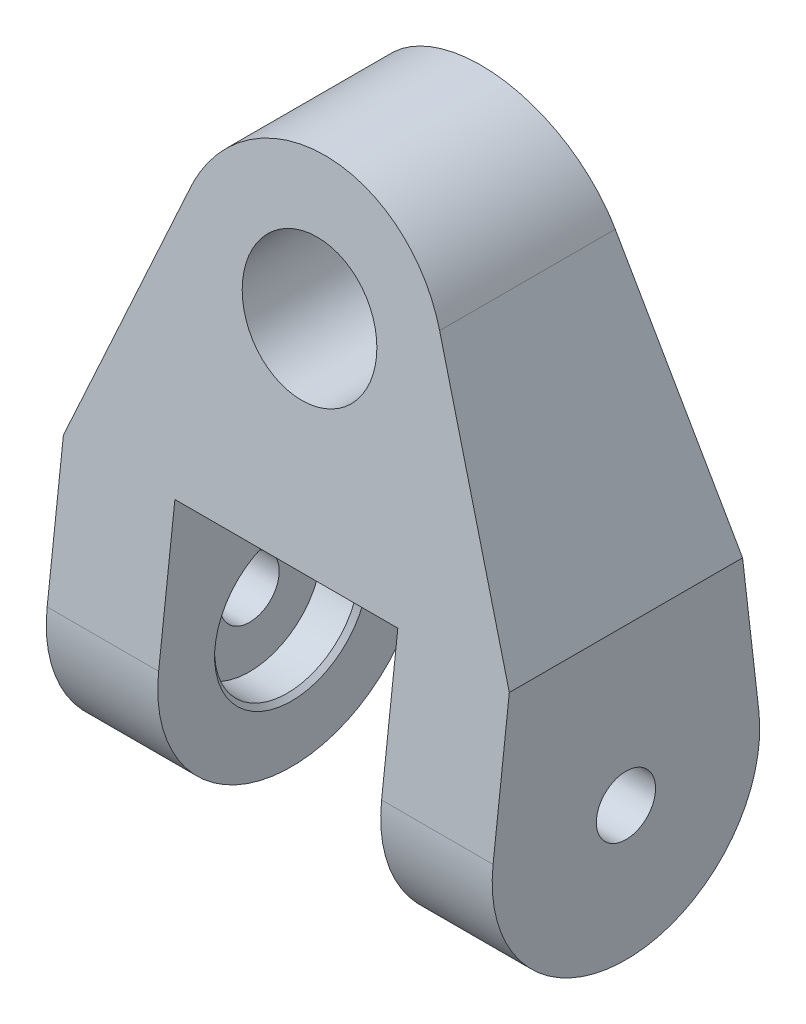
ISO-10303-21;
HEADER;
FILE_DESCRIPTION(('STEP AP214'),'2;1');
FILE_NAME('part.step','',(''),(''),'','','');
FILE_SCHEMA(('AUTOMOTIVE_DESIGN { 1 0 10303 214 1 1 1 1 }'));
ENDSEC;
DATA;
#1=APPLICATION_CONTEXT('core data for automotive mechanical design processes');
#2=APPLICATION_PROTOCOL_DEFINITION('international standard','automotive_design',2000,#1);
#3=PRODUCT_CONTEXT('',#1,'mechanical');
#4=PRODUCT('Part','Part','',(#3));
#5=PRODUCT_RELATED_PRODUCT_CATEGORY('part','',(#4));
#6=PRODUCT_DEFINITION_FORMATION('','',#4);
#7=PRODUCT_DEFINITION_CONTEXT('part definition',#1,'design');
#8=PRODUCT_DEFINITION('design','',#6,#7);
#9=PRODUCT_DEFINITION_SHAPE('','',#8);
#10=(LENGTH_UNIT() NAMED_UNIT(*) SI_UNIT(.MILLI.,.METRE.));
#11=(NAMED_UNIT(*) PLANE_ANGLE_UNIT() SI_UNIT($,.RADIAN.));
#12=(NAMED_UNIT(*) SI_UNIT($,.STERADIAN.) SOLID_ANGLE_UNIT());
#13=UNCERTAINTY_MEASURE_WITH_UNIT(LENGTH_MEASURE(1.E-05),#10,'distance_accuracy_value','');
#14=(GEOMETRIC_REPRESENTATION_CONTEXT(3) GLOBAL_UNCERTAINTY_ASSIGNED_CONTEXT((#13)) GLOBAL_UNIT_ASSIGNED_CONTEXT((#10,
#11,#12)) REPRESENTATION_CONTEXT('',''));
#15=CARTESIAN_POINT('',(0.,0.,0.));
#16=DIRECTION('',(0.,0.,1.));
#17=DIRECTION('',(1.,0.,0.));
#18=AXIS2_PLACEMENT_3D('',#15,#16,#17);
#19=CARTESIAN_POINT('',(0.,28.575,19.05));
#20=DIRECTION('',(0.,0.,-1.));
#21=DIRECTION('',(-1.,0.,0.));
#22=AXIS2_PLACEMENT_3D('',#19,#20,#21);
#23=CYLINDRICAL_SURFACE('',#22,9.525);
#24=CARTESIAN_POINT('',(0.,28.575,-13.3117811562931));
#25=DIRECTION('',(0.,0.114686079928993,-0.993401783303473));
#26=DIRECTION('',(0.,-0.993401783303473,-0.114686079928993));
#27=AXIS2_PLACEMENT_3D('',#24,#25,#26);
#28=ELLIPSE('',#27,9.58826545320406,9.525);
#29=CARTESIAN_POINT('',(0.,19.05,-14.4114217344397));
#30=VERTEX_POINT('',#29);
#31=EDGE_CURVE('E148',#30,#30,#28,.T.);
#32=ORIENTED_EDGE('',*,*,#31,.T.);
#33=EDGE_LOOP('',(#32));
#34=FACE_BOUND('',#33,.T.);
#35=CARTESIAN_POINT('',(0.,28.575,13.3117811562931));
#36=DIRECTION('',(0.,0.114686079928993,0.993401783303473));
#37=DIRECTION('',(0.,0.993401783303473,-0.114686079928993));
#38=AXIS2_PLACEMENT_3D('',#35,#36,#37);
#39=ELLIPSE('',#38,9.58826545320406,9.525);
#40=CARTESIAN_POINT('',(0.,38.1,12.2121405781466));
#41=VERTEX_POINT('',#40);
#42=EDGE_CURVE('E40',#41,#41,#39,.T.);
#43=ORIENTED_EDGE('',*,*,#42,.T.);
#44=EDGE_LOOP('',(#43));
#45=FACE_BOUND('',#44,.T.);
#46=ADVANCED_FACE('F36',(#34,#45),#23,.F.);
#47=CARTESIAN_POINT('',(-31.75,-22.225,0.));
#48=DIRECTION('',(1.,0.,0.));
#49=DIRECTION('',(0.,0.,-1.));
#50=AXIS2_PLACEMENT_3D('',#47,#48,#49);
#51=CYLINDRICAL_SURFACE('',#50,19.05);
#52=CARTESIAN_POINT('',(15.875,-22.225,0.));
#53=DIRECTION('',(1.,0.,0.));
#54=DIRECTION('',(0.,1.,0.));
#55=AXIS2_PLACEMENT_3D('',#52,#53,#54);
#56=CIRCLE('',#55,19.05);
#57=CARTESIAN_POINT('',(15.875,-20.0402301773527,18.9243039719312));
#58=VERTEX_POINT('',#57);
#59=CARTESIAN_POINT('',(15.875,-20.0402301773527,-18.9243039719312));
#60=VERTEX_POINT('',#59);
#61=EDGE_CURVE('E53',#58,#60,#56,.T.);
#62=ORIENTED_EDGE('',*,*,#61,.T.);
#63=DIRECTION('',(1.,0.,0.));
#64=VECTOR('',#63,1.);
#65=CARTESIAN_POINT('',(-31.75,-20.0402301773527,-18.9243039719312));
#66=LINE('',#65,#64);
#67=CARTESIAN_POINT('',(31.75,-20.0402301773527,-18.9243039719312));
#68=VERTEX_POINT('',#67);
#69=EDGE_CURVE('E127',#60,#68,#66,.T.);
#70=ORIENTED_EDGE('',*,*,#69,.T.);
#71=CARTESIAN_POINT('',(31.75,-22.225,0.));
#72=DIRECTION('',(1.,0.,0.));
#73=DIRECTION('',(0.,0.,-1.));
#74=AXIS2_PLACEMENT_3D('',#71,#72,#73);
#75=CIRCLE('',#74,19.05);
#76=CARTESIAN_POINT('',(31.75,-20.0402301773527,18.9243039719312));
#77=VERTEX_POINT('',#76);
#78=EDGE_CURVE('E118',#77,#68,#75,.T.);
#79=ORIENTED_EDGE('',*,*,#78,.F.);
#80=DIRECTION('',(1.,0.,0.));
#81=VECTOR('',#80,1.);
#82=CARTESIAN_POINT('',(-31.75,-20.0402301773527,18.9243039719312));
#83=LINE('',#82,#81);
#84=EDGE_CURVE('E149',#58,#77,#83,.T.);
#85=ORIENTED_EDGE('',*,*,#84,.F.);
#86=EDGE_LOOP('',(#62,#70,#79,#85));
#87=FACE_BOUND('',#86,.T.);
#88=ADVANCED_FACE('F128',(#87),#51,.T.);
#89=CARTESIAN_POINT('',(-31.75,-20.0402301773527,18.9243039719312));
#90=VERTEX_POINT('',#89);
#91=CARTESIAN_POINT('',(-15.875,-20.0402301773527,18.9243039719312));
#92=VERTEX_POINT('',#91);
#93=EDGE_CURVE('E146',#90,#92,#83,.T.);
#94=ORIENTED_EDGE('',*,*,#93,.F.);
#95=CARTESIAN_POINT('',(-31.75,-22.225,0.));
#96=DIRECTION('',(1.,0.,0.));
#97=DIRECTION('',(0.,0.,-1.));
#98=AXIS2_PLACEMENT_3D('',#95,#96,#97);
#99=CIRCLE('',#98,19.05);
#100=CARTESIAN_POINT('',(-31.75,-20.0402301773527,-18.9243039719312));
#101=VERTEX_POINT('',#100);
#102=EDGE_CURVE('E137',#90,#101,#99,.T.);
#103=ORIENTED_EDGE('',*,*,#102,.T.);
#104=CARTESIAN_POINT('',(-15.875,-20.0402301773527,-18.9243039719312));
#105=VERTEX_POINT('',#104);
#106=EDGE_CURVE('E130',#101,#105,#66,.T.);
#107=ORIENTED_EDGE('',*,*,#106,.T.);
#108=CARTESIAN_POINT('',(-15.875,-22.225,0.));
#109=DIRECTION('',(-1.,0.,0.));
#110=DIRECTION('',(0.,-1.,0.));
#111=AXIS2_PLACEMENT_3D('',#108,#109,#110);
#112=CIRCLE('',#111,19.05);
#113=EDGE_CURVE('E176',#105,#92,#112,.T.);
#114=ORIENTED_EDGE('',*,*,#113,.T.);
#115=EDGE_LOOP('',(#94,#103,#107,#114));
#116=FACE_BOUND('',#115,.T.);
#117=ADVANCED_FACE('F206',(#116),#51,.T.);
#118=CARTESIAN_POINT('',(-31.75,-20.0402301773527,18.9243039719312));
#119=DIRECTION('',(0.,0.114686079928993,0.993401783303473));
#120=DIRECTION('',(0.,-0.993401783303473,0.114686079928993));
#121=AXIS2_PLACEMENT_3D('',#118,#119,#120);
#122=PLANE('',#121);
#123=ORIENTED_EDGE('',*,*,#42,.F.);
#124=EDGE_LOOP('',(#123));
#125=FACE_BOUND('',#124,.T.);
#126=DIRECTION('',(0.,0.993401783303473,-0.114686079928993));
#127=VECTOR('',#126,1.);
#128=CARTESIAN_POINT('',(-15.875,-41.0100217287716,21.3452208963632));
#129=LINE('',#128,#127);
#130=CARTESIAN_POINT('',(-15.875,0.,16.6107028907328));
#131=VERTEX_POINT('',#130);
#132=EDGE_CURVE('E173',#92,#131,#129,.T.);
#133=ORIENTED_EDGE('',*,*,#132,.T.);
#134=DIRECTION('',(1.,0.,0.));
#135=VECTOR('',#134,1.);
#136=CARTESIAN_POINT('',(15.875,0.,16.6107028907328));
#137=LINE('',#136,#135);
#138=CARTESIAN_POINT('',(15.875,0.,16.6107028907328));
#139=VERTEX_POINT('',#138);
#140=EDGE_CURVE('E171',#131,#139,#137,.T.);
#141=ORIENTED_EDGE('',*,*,#140,.T.);
#142=DIRECTION('',(0.,-0.993401783303473,0.114686079928993));
#143=VECTOR('',#142,1.);
#144=CARTESIAN_POINT('',(15.875,-41.0100217287716,21.3452208963632));
#145=LINE('',#144,#143);
#146=EDGE_CURVE('E169',#139,#58,#145,.T.);
#147=ORIENTED_EDGE('',*,*,#146,.T.);
#148=ORIENTED_EDGE('',*,*,#84,.T.);
#149=DIRECTION('',(0.,-0.993401783303473,0.114686079928993));
#150=VECTOR('',#149,1.);
#151=CARTESIAN_POINT('',(31.75,-20.0402301773527,18.9243039719312));
#152=LINE('',#151,#150);
#153=CARTESIAN_POINT('',(31.75,0.,16.6107028907328));
#154=VERTEX_POINT('',#153);
#155=EDGE_CURVE('E124',#154,#77,#152,.T.);
#156=ORIENTED_EDGE('',*,*,#155,.F.);
#157=DIRECTION('',(-0.364840987183071,0.924926443231026,-0.106780750527833));
#158=VECTOR('',#157,1.);
#159=CARTESIAN_POINT('',(17.9761565755504,34.9187521570997,12.5794087374321));
#160=LINE('',#159,#158);
#161=CARTESIAN_POINT('',(17.7211679035024,35.5651865594471,12.5047792886204));
#162=VERTEX_POINT('',#161);
#163=EDGE_CURVE('E162',#154,#162,#160,.T.);
#164=ORIENTED_EDGE('',*,*,#163,.T.);
#165=CARTESIAN_POINT('',(0.,28.575,13.3117811562931));
#166=DIRECTION('',(0.,0.114686079928993,0.993401783303473));
#167=DIRECTION('',(0.,0.993401783303473,-0.114686079928993));
#168=AXIS2_PLACEMENT_3D('',#165,#166,#167);
#169=ELLIPSE('',#168,19.1765309064081,19.05);
#170=CARTESIAN_POINT('',(-17.7211679035024,35.5651865594471,12.5047792886204));
#171=VERTEX_POINT('',#170);
#172=EDGE_CURVE('E165',#162,#171,#169,.T.);
#173=ORIENTED_EDGE('',*,*,#172,.T.);
#174=DIRECTION('',(-0.36484098718307,-0.924926443231025,0.106780750527833));
#175=VECTOR('',#174,1.);
#176=CARTESIAN_POINT('',(-17.9761565755504,34.9187521570997,12.5794087374321));
#177=LINE('',#176,#175);
#178=CARTESIAN_POINT('',(-31.75,0.,16.6107028907328));
#179=VERTEX_POINT('',#178);
#180=EDGE_CURVE('E167',#171,#179,#177,.T.);
#181=ORIENTED_EDGE('',*,*,#180,.T.);
#182=DIRECTION('',(0.,-0.993401783303473,0.114686079928993));
#183=VECTOR('',#182,1.);
#184=CARTESIAN_POINT('',(-31.75,-20.0402301773527,18.9243039719312));
#185=LINE('',#184,#183);
#186=EDGE_CURVE('E131',#179,#90,#185,.T.);
#187=ORIENTED_EDGE('',*,*,#186,.T.);
#188=ORIENTED_EDGE('',*,*,#93,.T.);
#189=EDGE_LOOP('',(#133,#141,#147,#148,#156,#164,#173,#181,#187,#188));
#190=FACE_BOUND('',#189,.T.);
#191=ADVANCED_FACE('F197',(#125,#190),#122,.T.);
#192=CARTESIAN_POINT('',(-31.75,-20.0402301773527,-18.9243039719312));
#193=DIRECTION('',(0.,0.114686079928993,-0.993401783303473));
#194=DIRECTION('',(0.,0.993401783303473,0.114686079928993));
#195=AXIS2_PLACEMENT_3D('',#192,#193,#194);
#196=PLANE('',#195);
#197=ORIENTED_EDGE('',*,*,#31,.F.);
#198=EDGE_LOOP('',(#197));
#199=FACE_BOUND('',#198,.T.);
#200=DIRECTION('',(0.,-0.993401783303473,-0.114686079928993));
#201=VECTOR('',#200,1.);
#202=CARTESIAN_POINT('',(-15.875,-36.6693132529207,-20.84409552335));
#203=LINE('',#202,#201);
#204=CARTESIAN_POINT('',(-15.875,0.,-16.6107028907328));
#205=VERTEX_POINT('',#204);
#206=EDGE_CURVE('E160',#205,#105,#203,.T.);
#207=ORIENTED_EDGE('',*,*,#206,.T.);
#208=ORIENTED_EDGE('',*,*,#106,.F.);
#209=DIRECTION('',(0.,0.993401783303473,0.114686079928993));
#210=VECTOR('',#209,1.);
#211=CARTESIAN_POINT('',(-31.75,-20.0402301773527,-18.9243039719312));
#212=LINE('',#211,#210);
#213=CARTESIAN_POINT('',(-31.75,0.,-16.6107028907328));
#214=VERTEX_POINT('',#213);
#215=EDGE_CURVE('E142',#101,#214,#212,.T.);
#216=ORIENTED_EDGE('',*,*,#215,.T.);
#217=DIRECTION('',(0.36484098718307,0.924926443231025,0.106780750527833));
#218=VECTOR('',#217,1.);
#219=CARTESIAN_POINT('',(-16.4918569875874,38.6816735031463,-12.1449876345988));
#220=LINE('',#219,#218);
#221=CARTESIAN_POINT('',(-17.7211679035024,35.5651865594471,-12.5047792886204));
#222=VERTEX_POINT('',#221);
#223=EDGE_CURVE('E154',#214,#222,#220,.T.);
#224=ORIENTED_EDGE('',*,*,#223,.T.);
#225=CARTESIAN_POINT('',(0.,28.575,-13.3117811562931));
#226=DIRECTION('',(0.,0.114686079928993,-0.993401783303473));
#227=DIRECTION('',(0.,-0.993401783303473,-0.114686079928993));
#228=AXIS2_PLACEMENT_3D('',#225,#226,#227);
#229=ELLIPSE('',#228,19.1765309064081,19.05);
#230=CARTESIAN_POINT('',(17.7211679035024,35.5651865594471,-12.5047792886204));
#231=VERTEX_POINT('',#230);
#232=EDGE_CURVE('E61',#222,#231,#229,.T.);
#233=ORIENTED_EDGE('',*,*,#232,.T.);
#234=DIRECTION('',(0.364840987183071,-0.924926443231026,-0.106780750527833));
#235=VECTOR('',#234,1.);
#236=CARTESIAN_POINT('',(16.4918569875874,38.6816735031463,-12.1449876345988));
#237=LINE('',#236,#235);
#238=CARTESIAN_POINT('',(31.75,0.,-16.6107028907328));
#239=VERTEX_POINT('',#238);
#240=EDGE_CURVE('E135',#231,#239,#237,.T.);
#241=ORIENTED_EDGE('',*,*,#240,.T.);
#242=DIRECTION('',(0.,0.993401783303473,0.114686079928993));
#243=VECTOR('',#242,1.);
#244=CARTESIAN_POINT('',(31.75,-20.0402301773527,-18.9243039719312));
#245=LINE('',#244,#243);
#246=EDGE_CURVE('E122',#68,#239,#245,.T.);
#247=ORIENTED_EDGE('',*,*,#246,.F.);
#248=ORIENTED_EDGE('',*,*,#69,.F.);
#249=DIRECTION('',(0.,0.993401783303473,0.114686079928993));
#250=VECTOR('',#249,1.);
#251=CARTESIAN_POINT('',(15.875,-36.6693132529206,-20.84409552335));
#252=LINE('',#251,#250);
#253=CARTESIAN_POINT('',(15.875,0.,-16.6107028907328));
#254=VERTEX_POINT('',#253);
#255=EDGE_CURVE('E156',#60,#254,#252,.T.);
#256=ORIENTED_EDGE('',*,*,#255,.T.);
#257=DIRECTION('',(-1.,0.,0.));
#258=VECTOR('',#257,1.);
#259=CARTESIAN_POINT('',(15.875,0.,-16.6107028907328));
#260=LINE('',#259,#258);
#261=EDGE_CURVE('E158',#254,#205,#260,.T.);
#262=ORIENTED_EDGE('',*,*,#261,.T.);
#263=EDGE_LOOP('',(#207,#208,#216,#224,#233,#241,#247,#248,#256,#262));
#264=FACE_BOUND('',#263,.T.);
#265=ADVANCED_FACE('F134',(#199,#264),#196,.T.);
#266=CARTESIAN_POINT('',(-31.75,0.,19.05));
#267=DIRECTION('',(1.,0.,0.));
#268=DIRECTION('',(0.,1.,0.));
#269=AXIS2_PLACEMENT_3D('',#266,#267,#268);
#270=PLANE('',#269);
#271=CARTESIAN_POINT('',(-31.75,-22.225,0.));
#272=DIRECTION('',(1.,0.,0.));
#273=DIRECTION('',(0.,0.,-1.));
#274=AXIS2_PLACEMENT_3D('',#271,#272,#273);
#275=CIRCLE('',#274,4.2164);
#276=CARTESIAN_POINT('',(-31.75,-22.225,-4.2164));
#277=VERTEX_POINT('',#276);
#278=EDGE_CURVE('E125',#277,#277,#275,.T.);
#279=ORIENTED_EDGE('',*,*,#278,.T.);
#280=EDGE_LOOP('',(#279));
#281=FACE_BOUND('',#280,.T.);
#282=ORIENTED_EDGE('',*,*,#186,.F.);
#283=DIRECTION('',(0.,0.,-1.));
#284=VECTOR('',#283,1.);
#285=CARTESIAN_POINT('',(-31.75,0.,19.05));
#286=LINE('',#285,#284);
#287=EDGE_CURVE('E45',#179,#214,#286,.T.);
#288=ORIENTED_EDGE('',*,*,#287,.T.);
#289=ORIENTED_EDGE('',*,*,#215,.F.);
#290=ORIENTED_EDGE('',*,*,#102,.F.);
#291=EDGE_LOOP('',(#282,#288,#289,#290));
#292=FACE_BOUND('',#291,.T.);
#293=ADVANCED_FACE('F196',(#281,#292),#270,.F.);
#294=CARTESIAN_POINT('',(-17.7211679035024,35.5651865594471,19.05));
#295=DIRECTION('',(0.930245034304589,-0.366938927005099,0.));
#296=DIRECTION('',(0.366938927005099,0.930245034304589,0.));
#297=AXIS2_PLACEMENT_3D('',#294,#295,#296);
#298=PLANE('',#297);
#299=ORIENTED_EDGE('',*,*,#180,.F.);
#300=DIRECTION('',(0.,0.,-1.));
#301=VECTOR('',#300,1.);
#302=CARTESIAN_POINT('',(-17.7211679035024,35.5651865594471,19.05));
#303=LINE('',#302,#301);
#304=EDGE_CURVE('E12',#171,#222,#303,.T.);
#305=ORIENTED_EDGE('',*,*,#304,.T.);
#306=ORIENTED_EDGE('',*,*,#223,.F.);
#307=ORIENTED_EDGE('',*,*,#287,.F.);
#308=EDGE_LOOP('',(#299,#305,#306,#307));
#309=FACE_BOUND('',#308,.T.);
#310=ADVANCED_FACE('F203',(#309),#298,.F.);
#311=CARTESIAN_POINT('',(17.7211679035024,35.5651865594471,19.05));
#312=DIRECTION('',(-0.930245034304589,-0.3669389270051,0.));
#313=DIRECTION('',(0.3669389270051,-0.930245034304589,0.));
#314=AXIS2_PLACEMENT_3D('',#311,#312,#313);
#315=PLANE('',#314);
#316=ORIENTED_EDGE('',*,*,#163,.F.);
#317=DIRECTION('',(0.,0.,-1.));
#318=VECTOR('',#317,1.);
#319=CARTESIAN_POINT('',(31.75,0.,19.05));
#320=LINE('',#319,#318);
#321=EDGE_CURVE('E181',#154,#239,#320,.T.);
#322=ORIENTED_EDGE('',*,*,#321,.T.);
#323=ORIENTED_EDGE('',*,*,#240,.F.);
#324=DIRECTION('',(0.,0.,-1.));
#325=VECTOR('',#324,1.);
#326=CARTESIAN_POINT('',(17.7211679035024,35.5651865594471,19.05));
#327=LINE('',#326,#325);
#328=EDGE_CURVE('E178',#162,#231,#327,.T.);
#329=ORIENTED_EDGE('',*,*,#328,.F.);
#330=EDGE_LOOP('',(#316,#322,#323,#329));
#331=FACE_BOUND('',#330,.T.);
#332=ADVANCED_FACE('F216',(#331),#315,.F.);
#333=CARTESIAN_POINT('',(31.75,0.,19.05));
#334=DIRECTION('',(-1.,0.,0.));
#335=DIRECTION('',(0.,-1.,0.));
#336=AXIS2_PLACEMENT_3D('',#333,#334,#335);
#337=PLANE('',#336);
#338=CARTESIAN_POINT('',(31.75,-22.225,0.));
#339=DIRECTION('',(-1.,0.,0.));
#340=DIRECTION('',(0.,0.,1.));
#341=AXIS2_PLACEMENT_3D('',#338,#339,#340);
#342=CIRCLE('',#341,4.2164);
#343=CARTESIAN_POINT('',(31.75,-22.225,4.2164));
#344=VERTEX_POINT('',#343);
#345=EDGE_CURVE('E419',#344,#344,#342,.T.);
#346=ORIENTED_EDGE('',*,*,#345,.T.);
#347=EDGE_LOOP('',(#346));
#348=FACE_BOUND('',#347,.T.);
#349=ORIENTED_EDGE('',*,*,#155,.T.);
#350=ORIENTED_EDGE('',*,*,#78,.T.);
#351=ORIENTED_EDGE('',*,*,#246,.T.);
#352=ORIENTED_EDGE('',*,*,#321,.F.);
#353=EDGE_LOOP('',(#349,#350,#351,#352));
#354=FACE_BOUND('',#353,.T.);
#355=ADVANCED_FACE('F119',(#348,#354),#337,.F.);
#356=CARTESIAN_POINT('',(0.,28.575,19.05));
#357=DIRECTION('',(0.,0.,-1.));
#358=DIRECTION('',(-1.,0.,0.));
#359=AXIS2_PLACEMENT_3D('',#356,#357,#358);
#360=CYLINDRICAL_SURFACE('',#359,19.05);
#361=ORIENTED_EDGE('',*,*,#172,.F.);
#362=ORIENTED_EDGE('',*,*,#328,.T.);
#363=ORIENTED_EDGE('',*,*,#232,.F.);
#364=ORIENTED_EDGE('',*,*,#304,.F.);
#365=EDGE_LOOP('',(#361,#362,#363,#364));
#366=FACE_BOUND('',#365,.T.);
#367=ADVANCED_FACE('F38',(#366),#360,.T.);
#368=CARTESIAN_POINT('',(-15.875,-41.275,19.05));
#369=DIRECTION('',(-1.,0.,0.));
#370=DIRECTION('',(0.,-1.,0.));
#371=AXIS2_PLACEMENT_3D('',#368,#369,#370);
#372=PLANE('',#371);
#373=CARTESIAN_POINT('',(-15.875,-22.225,0.));
#374=DIRECTION('',(1.,0.,0.));
#375=DIRECTION('',(0.,0.,-1.));
#376=AXIS2_PLACEMENT_3D('',#373,#374,#375);
#377=CIRCLE('',#376,10.95375);
#378=CARTESIAN_POINT('',(-15.875,-22.225,-10.95375));
#379=VERTEX_POINT('',#378);
#380=EDGE_CURVE('E422',#379,#379,#377,.T.);
#381=ORIENTED_EDGE('',*,*,#380,.F.);
#382=EDGE_LOOP('',(#381));
#383=FACE_BOUND('',#382,.T.);
#384=ORIENTED_EDGE('',*,*,#132,.F.);
#385=ORIENTED_EDGE('',*,*,#113,.F.);
#386=ORIENTED_EDGE('',*,*,#206,.F.);
#387=DIRECTION('',(0.,0.,-1.));
#388=VECTOR('',#387,1.);
#389=CARTESIAN_POINT('',(-15.875,0.,19.05));
#390=LINE('',#389,#388);
#391=EDGE_CURVE('E186',#131,#205,#390,.T.);
#392=ORIENTED_EDGE('',*,*,#391,.F.);
#393=EDGE_LOOP('',(#384,#385,#386,#392));
#394=FACE_BOUND('',#393,.T.);
#395=ADVANCED_FACE('F231',(#383,#394),#372,.F.);
#396=CARTESIAN_POINT('',(15.875,0.,19.05));
#397=DIRECTION('',(0.,1.,0.));
#398=DIRECTION('',(-1.,0.,0.));
#399=AXIS2_PLACEMENT_3D('',#396,#397,#398);
#400=PLANE('',#399);
#401=ORIENTED_EDGE('',*,*,#140,.F.);
#402=ORIENTED_EDGE('',*,*,#391,.T.);
#403=ORIENTED_EDGE('',*,*,#261,.F.);
#404=DIRECTION('',(0.,0.,-1.));
#405=VECTOR('',#404,1.);
#406=CARTESIAN_POINT('',(15.875,0.,19.05));
#407=LINE('',#406,#405);
#408=EDGE_CURVE('E183',#139,#254,#407,.T.);
#409=ORIENTED_EDGE('',*,*,#408,.F.);
#410=EDGE_LOOP('',(#401,#402,#403,#409));
#411=FACE_BOUND('',#410,.T.);
#412=ADVANCED_FACE('F227',(#411),#400,.F.);
#413=CARTESIAN_POINT('',(15.875,-41.275,19.05));
#414=DIRECTION('',(1.,0.,0.));
#415=DIRECTION('',(0.,1.,0.));
#416=AXIS2_PLACEMENT_3D('',#413,#414,#415);
#417=PLANE('',#416);
#418=CARTESIAN_POINT('',(15.875,-22.225,0.));
#419=DIRECTION('',(-1.,0.,0.));
#420=DIRECTION('',(0.,0.,1.));
#421=AXIS2_PLACEMENT_3D('',#418,#419,#420);
#422=CIRCLE('',#421,10.95375);
#423=CARTESIAN_POINT('',(15.875,-22.225,10.95375));
#424=VERTEX_POINT('',#423);
#425=EDGE_CURVE('E409',#424,#424,#422,.T.);
#426=ORIENTED_EDGE('',*,*,#425,.F.);
#427=EDGE_LOOP('',(#426));
#428=FACE_BOUND('',#427,.T.);
#429=ORIENTED_EDGE('',*,*,#146,.F.);
#430=ORIENTED_EDGE('',*,*,#408,.T.);
#431=ORIENTED_EDGE('',*,*,#255,.F.);
#432=ORIENTED_EDGE('',*,*,#61,.F.);
#433=EDGE_LOOP('',(#429,#430,#431,#432));
#434=FACE_BOUND('',#433,.T.);
#435=ADVANCED_FACE('F223',(#428,#434),#417,.F.);
#436=CARTESIAN_POINT('',(-15.875,-22.225,0.));
#437=DIRECTION('',(1.,0.,0.));
#438=DIRECTION('',(0.,0.,-1.));
#439=AXIS2_PLACEMENT_3D('',#436,#437,#438);
#440=CYLINDRICAL_SURFACE('',#439,4.2164);
#441=ORIENTED_EDGE('',*,*,#278,.F.);
#442=EDGE_LOOP('',(#441));
#443=FACE_BOUND('',#442,.T.);
#444=CARTESIAN_POINT('',(-21.844,-22.225,0.));
#445=DIRECTION('',(1.,0.,0.));
#446=DIRECTION('',(0.,0.,-1.));
#447=AXIS2_PLACEMENT_3D('',#444,#445,#446);
#448=CIRCLE('',#447,4.21640000000001);
#449=CARTESIAN_POINT('',(-21.844,-22.225,-4.21640000000001));
#450=VERTEX_POINT('',#449);
#451=EDGE_CURVE('E431',#450,#450,#448,.T.);
#452=ORIENTED_EDGE('',*,*,#451,.T.);
#453=EDGE_LOOP('',(#452));
#454=FACE_BOUND('',#453,.T.);
#455=ADVANCED_FACE('F226',(#443,#454),#440,.F.);
#456=CARTESIAN_POINT('',(-21.844,-11.90625,0.));
#457=DIRECTION('',(-1.,0.,0.));
#458=DIRECTION('',(0.,0.,1.));
#459=AXIS2_PLACEMENT_3D('',#456,#457,#458);
#460=PLANE('',#459);
#461=ORIENTED_EDGE('',*,*,#451,.F.);
#462=EDGE_LOOP('',(#461));
#463=FACE_BOUND('',#462,.T.);
#464=CARTESIAN_POINT('',(-21.844,-22.225,0.));
#465=DIRECTION('',(1.,0.,0.));
#466=DIRECTION('',(0.,0.,-1.));
#467=AXIS2_PLACEMENT_3D('',#464,#465,#466);
#468=CIRCLE('',#467,10.31875);
#469=CARTESIAN_POINT('',(-21.844,-22.225,-10.31875));
#470=VERTEX_POINT('',#469);
#471=EDGE_CURVE('E428',#470,#470,#468,.T.);
#472=ORIENTED_EDGE('',*,*,#471,.T.);
#473=EDGE_LOOP('',(#472));
#474=FACE_BOUND('',#473,.T.);
#475=ADVANCED_FACE('F325',(#463,#474),#460,.F.);
#476=CARTESIAN_POINT('',(-15.875,-22.225,0.));
#477=DIRECTION('',(1.,0.,0.));
#478=DIRECTION('',(0.,0.,-1.));
#479=AXIS2_PLACEMENT_3D('',#476,#477,#478);
#480=CYLINDRICAL_SURFACE('',#479,10.31875);
#481=ORIENTED_EDGE('',*,*,#471,.F.);
#482=EDGE_LOOP('',(#481));
#483=FACE_BOUND('',#482,.T.);
#484=CARTESIAN_POINT('',(-16.51,-22.225,0.));
#485=DIRECTION('',(1.,0.,0.));
#486=DIRECTION('',(0.,0.,-1.));
#487=AXIS2_PLACEMENT_3D('',#484,#485,#486);
#488=CIRCLE('',#487,10.31875);
#489=CARTESIAN_POINT('',(-16.51,-22.225,-10.31875));
#490=VERTEX_POINT('',#489);
#491=EDGE_CURVE('E425',#490,#490,#488,.T.);
#492=ORIENTED_EDGE('',*,*,#491,.T.);
#493=EDGE_LOOP('',(#492));
#494=FACE_BOUND('',#493,.T.);
#495=ADVANCED_FACE('F335',(#483,#494),#480,.F.);
#496=CARTESIAN_POINT('',(-15.875,-22.225,0.));
#497=DIRECTION('',(1.,0.,0.));
#498=DIRECTION('',(0.,0.,-1.));
#499=AXIS2_PLACEMENT_3D('',#496,#497,#498);
#500=CONICAL_SURFACE('',#499,10.95375,0.785398163397452);
#501=ORIENTED_EDGE('',*,*,#491,.F.);
#502=EDGE_LOOP('',(#501));
#503=FACE_BOUND('',#502,.T.);
#504=ORIENTED_EDGE('',*,*,#380,.T.);
#505=EDGE_LOOP('',(#504));
#506=FACE_BOUND('',#505,.T.);
#507=ADVANCED_FACE('F345',(#503,#506),#500,.F.);
#508=CARTESIAN_POINT('',(15.875,-22.225,0.));
#509=DIRECTION('',(-1.,0.,0.));
#510=DIRECTION('',(0.,0.,1.));
#511=AXIS2_PLACEMENT_3D('',#508,#509,#510);
#512=CYLINDRICAL_SURFACE('',#511,4.2164);
#513=ORIENTED_EDGE('',*,*,#345,.F.);
#514=EDGE_LOOP('',(#513));
#515=FACE_BOUND('',#514,.T.);
#516=CARTESIAN_POINT('',(21.844,-22.225,0.));
#517=DIRECTION('',(-1.,0.,0.));
#518=DIRECTION('',(0.,0.,1.));
#519=AXIS2_PLACEMENT_3D('',#516,#517,#518);
#520=CIRCLE('',#519,4.21640000000001);
#521=CARTESIAN_POINT('',(21.844,-22.225,4.21640000000001));
#522=VERTEX_POINT('',#521);
#523=EDGE_CURVE('E416',#522,#522,#520,.T.);
#524=ORIENTED_EDGE('',*,*,#523,.T.);
#525=EDGE_LOOP('',(#524));
#526=FACE_BOUND('',#525,.T.);
#527=ADVANCED_FACE('F354',(#515,#526),#512,.F.);
#528=CARTESIAN_POINT('',(21.844,-11.90625,0.));
#529=DIRECTION('',(1.,0.,0.));
#530=DIRECTION('',(0.,0.,-1.));
#531=AXIS2_PLACEMENT_3D('',#528,#529,#530);
#532=PLANE('',#531);
#533=ORIENTED_EDGE('',*,*,#523,.F.);
#534=EDGE_LOOP('',(#533));
#535=FACE_BOUND('',#534,.T.);
#536=CARTESIAN_POINT('',(21.844,-22.225,0.));
#537=DIRECTION('',(-1.,0.,0.));
#538=DIRECTION('',(0.,0.,1.));
#539=AXIS2_PLACEMENT_3D('',#536,#537,#538);
#540=CIRCLE('',#539,10.31875);
#541=CARTESIAN_POINT('',(21.844,-22.225,10.31875));
#542=VERTEX_POINT('',#541);
#543=EDGE_CURVE('E411',#542,#542,#540,.T.);
#544=ORIENTED_EDGE('',*,*,#543,.T.);
#545=EDGE_LOOP('',(#544));
#546=FACE_BOUND('',#545,.T.);
#547=ADVANCED_FACE('F369',(#535,#546),#532,.F.);
#548=CARTESIAN_POINT('',(15.875,-22.225,0.));
#549=DIRECTION('',(-1.,0.,0.));
#550=DIRECTION('',(0.,0.,1.));
#551=AXIS2_PLACEMENT_3D('',#548,#549,#550);
#552=CYLINDRICAL_SURFACE('',#551,10.31875);
#553=ORIENTED_EDGE('',*,*,#543,.F.);
#554=EDGE_LOOP('',(#553));
#555=FACE_BOUND('',#554,.T.);
#556=CARTESIAN_POINT('',(16.51,-22.225,0.));
#557=DIRECTION('',(-1.,0.,0.));
#558=DIRECTION('',(0.,0.,1.));
#559=AXIS2_PLACEMENT_3D('',#556,#557,#558);
#560=CIRCLE('',#559,10.31875);
#561=CARTESIAN_POINT('',(16.51,-22.225,10.31875));
#562=VERTEX_POINT('',#561);
#563=EDGE_CURVE('E406',#562,#562,#560,.T.);
#564=ORIENTED_EDGE('',*,*,#563,.T.);
#565=EDGE_LOOP('',(#564));
#566=FACE_BOUND('',#565,.T.);
#567=ADVANCED_FACE('F379',(#555,#566),#552,.F.);
#568=CARTESIAN_POINT('',(15.875,-22.225,0.));
#569=DIRECTION('',(-1.,0.,0.));
#570=DIRECTION('',(0.,0.,1.));
#571=AXIS2_PLACEMENT_3D('',#568,#569,#570);
#572=CONICAL_SURFACE('',#571,10.95375,0.785398163397452);
#573=ORIENTED_EDGE('',*,*,#563,.F.);
#574=EDGE_LOOP('',(#573));
#575=FACE_BOUND('',#574,.T.);
#576=ORIENTED_EDGE('',*,*,#425,.T.);
#577=EDGE_LOOP('',(#576));
#578=FACE_BOUND('',#577,.T.);
#579=ADVANCED_FACE('F389',(#575,#578),#572,.F.);
#580=CLOSED_SHELL('',(#46,#88,#117,#191,#265,#293,#310,#332,#355,#367,#395,#412,#435,#455,#475,
#495,#507,#527,#547,#567,#579));
#581=MANIFOLD_SOLID_BREP('B2',#580);
#582=ADVANCED_BREP_SHAPE_REPRESENTATION('',(#18,#581),#14);
#583=SHAPE_DEFINITION_REPRESENTATION(#9,#582);
ENDSEC;
END-ISO-10303-21;
